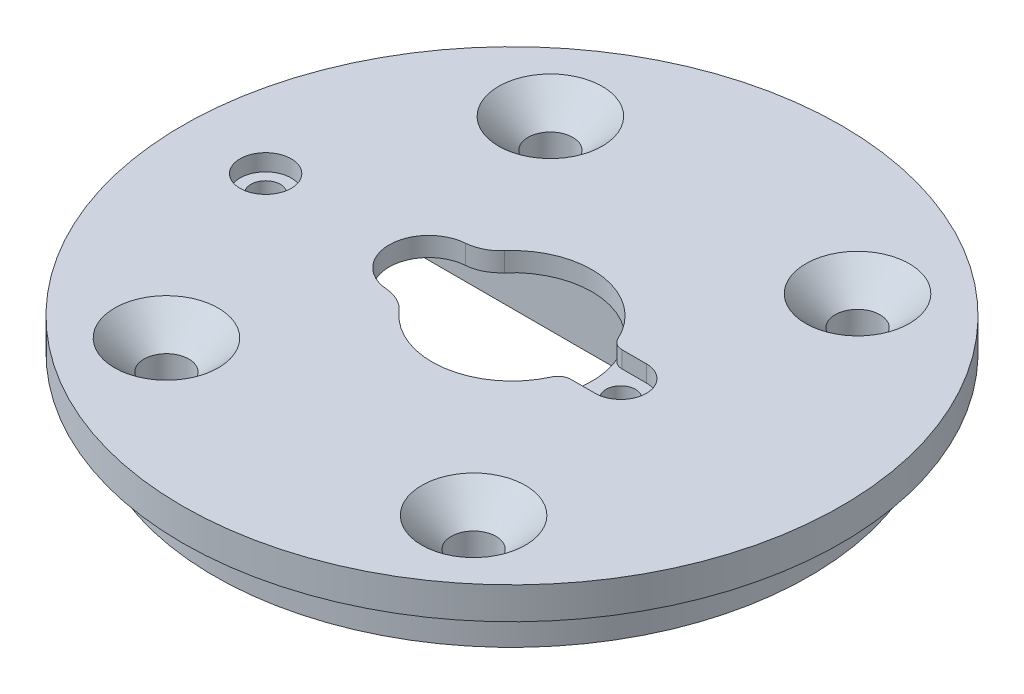
ISO-10303-21;
HEADER;
FILE_DESCRIPTION(('STEP AP214'),'2;1');
FILE_NAME('part.step','',(''),(''),'','','');
FILE_SCHEMA(('AUTOMOTIVE_DESIGN { 1 0 10303 214 1 1 1 1 }'));
ENDSEC;
DATA;
#1=APPLICATION_CONTEXT('core data for automotive mechanical design processes');
#2=APPLICATION_PROTOCOL_DEFINITION('international standard','automotive_design',2000,#1);
#3=PRODUCT_CONTEXT('',#1,'mechanical');
#4=PRODUCT('Part','Part','',(#3));
#5=PRODUCT_RELATED_PRODUCT_CATEGORY('part','',(#4));
#6=PRODUCT_DEFINITION_FORMATION('','',#4);
#7=PRODUCT_DEFINITION_CONTEXT('part definition',#1,'design');
#8=PRODUCT_DEFINITION('design','',#6,#7);
#9=PRODUCT_DEFINITION_SHAPE('','',#8);
#10=(LENGTH_UNIT() NAMED_UNIT(*) SI_UNIT(.MILLI.,.METRE.));
#11=(NAMED_UNIT(*) PLANE_ANGLE_UNIT() SI_UNIT($,.RADIAN.));
#12=(NAMED_UNIT(*) SI_UNIT($,.STERADIAN.) SOLID_ANGLE_UNIT());
#13=UNCERTAINTY_MEASURE_WITH_UNIT(LENGTH_MEASURE(1.E-05),#10,'distance_accuracy_value','');
#14=(GEOMETRIC_REPRESENTATION_CONTEXT(3) GLOBAL_UNCERTAINTY_ASSIGNED_CONTEXT((#13)) GLOBAL_UNIT_ASSIGNED_CONTEXT((#10,
#11,#12)) REPRESENTATION_CONTEXT('',''));
#15=CARTESIAN_POINT('',(0.,0.,0.));
#16=DIRECTION('',(0.,0.,1.));
#17=DIRECTION('',(1.,0.,0.));
#18=AXIS2_PLACEMENT_3D('',#15,#16,#17);
#19=CARTESIAN_POINT('',(37.5,0.,-13.));
#20=DIRECTION('',(0.,1.,0.));
#21=DIRECTION('',(0.,0.,1.));
#22=AXIS2_PLACEMENT_3D('',#19,#20,#21);
#23=CYLINDRICAL_SURFACE('',#22,1.15);
#24=CARTESIAN_POINT('',(37.5,0.5,-13.));
#25=DIRECTION('',(0.,-1.,0.));
#26=DIRECTION('',(0.,0.,-1.));
#27=AXIS2_PLACEMENT_3D('',#24,#25,#26);
#28=CIRCLE('',#27,1.15);
#29=CARTESIAN_POINT('',(37.5,0.5,-14.15));
#30=VERTEX_POINT('',#29);
#31=EDGE_CURVE('E237',#30,#30,#28,.T.);
#32=ORIENTED_EDGE('',*,*,#31,.T.);
#33=EDGE_LOOP('',(#32));
#34=FACE_BOUND('',#33,.T.);
#35=CARTESIAN_POINT('',(37.5,4.7,-13.));
#36=DIRECTION('',(0.,1.,0.));
#37=DIRECTION('',(0.,0.,1.));
#38=AXIS2_PLACEMENT_3D('',#35,#36,#37);
#39=CIRCLE('',#38,1.15);
#40=CARTESIAN_POINT('',(37.5,4.7,-11.85));
#41=VERTEX_POINT('',#40);
#42=EDGE_CURVE('E181',#41,#41,#39,.F.);
#43=ORIENTED_EDGE('',*,*,#42,.F.);
#44=EDGE_LOOP('',(#43));
#45=FACE_BOUND('',#44,.T.);
#46=ADVANCED_FACE('F37',(#34,#45),#23,.F.);
#47=CARTESIAN_POINT('',(0.,6.,0.));
#48=DIRECTION('',(0.,1.,0.));
#49=DIRECTION('',(0.,0.,1.));
#50=AXIS2_PLACEMENT_3D('',#47,#48,#49);
#51=PLANE('',#50);
#52=CARTESIAN_POINT('',(41.,6.,2.));
#53=DIRECTION('',(0.,1.,0.));
#54=DIRECTION('',(0.,0.,1.));
#55=AXIS2_PLACEMENT_3D('',#52,#53,#54);
#56=CIRCLE('',#55,4.04999999999999);
#57=CARTESIAN_POINT('',(41.,6.,6.04999999999999));
#58=VERTEX_POINT('',#57);
#59=EDGE_CURVE('E346',#58,#58,#56,.F.);
#60=ORIENTED_EDGE('',*,*,#59,.T.);
#61=EDGE_LOOP('',(#60));
#62=FACE_BOUND('',#61,.T.);
#63=CARTESIAN_POINT('',(41.,6.,-28.));
#64=DIRECTION('',(0.,1.,0.));
#65=DIRECTION('',(0.,0.,1.));
#66=AXIS2_PLACEMENT_3D('',#63,#64,#65);
#67=CIRCLE('',#66,4.05);
#68=CARTESIAN_POINT('',(41.,6.,-23.95));
#69=VERTEX_POINT('',#68);
#70=EDGE_CURVE('E343',#69,#69,#67,.F.);
#71=ORIENTED_EDGE('',*,*,#70,.T.);
#72=EDGE_LOOP('',(#71));
#73=FACE_BOUND('',#72,.T.);
#74=CARTESIAN_POINT('',(17.,6.,-28.));
#75=DIRECTION('',(0.,1.,0.));
#76=DIRECTION('',(0.,0.,1.));
#77=AXIS2_PLACEMENT_3D('',#74,#75,#76);
#78=CIRCLE('',#77,4.05);
#79=CARTESIAN_POINT('',(17.,6.,-23.95));
#80=VERTEX_POINT('',#79);
#81=EDGE_CURVE('E340',#80,#80,#78,.F.);
#82=ORIENTED_EDGE('',*,*,#81,.T.);
#83=EDGE_LOOP('',(#82));
#84=FACE_BOUND('',#83,.T.);
#85=CARTESIAN_POINT('',(17.,6.,2.));
#86=DIRECTION('',(0.,1.,0.));
#87=DIRECTION('',(0.,0.,1.));
#88=AXIS2_PLACEMENT_3D('',#85,#86,#87);
#89=CIRCLE('',#88,4.04999999999999);
#90=CARTESIAN_POINT('',(17.,6.,6.04999999999999));
#91=VERTEX_POINT('',#90);
#92=EDGE_CURVE('E337',#91,#91,#89,.F.);
#93=ORIENTED_EDGE('',*,*,#92,.T.);
#94=EDGE_LOOP('',(#93));
#95=FACE_BOUND('',#94,.T.);
#96=CARTESIAN_POINT('',(29.,6.,-13.));
#97=DIRECTION('',(0.,1.,0.));
#98=DIRECTION('',(0.,0.,1.));
#99=AXIS2_PLACEMENT_3D('',#96,#97,#98);
#100=CIRCLE('',#99,25.75);
#101=CARTESIAN_POINT('',(29.,6.,12.75));
#102=VERTEX_POINT('',#101);
#103=EDGE_CURVE('E291',#102,#102,#100,.T.);
#104=ORIENTED_EDGE('',*,*,#103,.T.);
#105=EDGE_LOOP('',(#104));
#106=FACE_BOUND('',#105,.T.);
#107=CARTESIAN_POINT('',(9.75000000000001,6.,-13.));
#108=DIRECTION('',(0.,1.,0.));
#109=DIRECTION('',(0.,0.,1.));
#110=AXIS2_PLACEMENT_3D('',#107,#108,#109);
#111=CIRCLE('',#110,2.);
#112=CARTESIAN_POINT('',(9.75000000000001,6.,-11.));
#113=VERTEX_POINT('',#112);
#114=EDGE_CURVE('E201',#113,#113,#111,.T.);
#115=ORIENTED_EDGE('',*,*,#114,.F.);
#116=EDGE_LOOP('',(#115));
#117=FACE_BOUND('',#116,.T.);
#118=DIRECTION('',(-1.,0.,0.));
#119=VECTOR('',#118,1.);
#120=CARTESIAN_POINT('',(0.,6.,-11.));
#121=LINE('',#120,#119);
#122=CARTESIAN_POINT('',(37.5,6.,-11.));
#123=VERTEX_POINT('',#122);
#124=CARTESIAN_POINT('',(35.6001893912221,6.,-11.));
#125=VERTEX_POINT('',#124);
#126=EDGE_CURVE('E184',#123,#125,#121,.T.);
#127=ORIENTED_EDGE('',*,*,#126,.T.);
#128=CARTESIAN_POINT('',(35.6001893912221,6.,-9.99999999999999));
#129=DIRECTION('',(0.,1.,0.));
#130=DIRECTION('',(0.,0.,1.));
#131=AXIS2_PLACEMENT_3D('',#128,#129,#130);
#132=CIRCLE('',#131,1.);
#133=CARTESIAN_POINT('',(34.6898184407087,6.,-10.4137931034483));
#134=VERTEX_POINT('',#133);
#135=EDGE_CURVE('E325',#125,#134,#132,.T.);
#136=ORIENTED_EDGE('',*,*,#135,.T.);
#137=CARTESIAN_POINT('',(29.,6.,-13.));
#138=DIRECTION('',(0.,1.,0.));
#139=DIRECTION('',(0.,0.,1.));
#140=AXIS2_PLACEMENT_3D('',#137,#138,#139);
#141=CIRCLE('',#140,6.25000000000001);
#142=CARTESIAN_POINT('',(24.2909303534303,6.,-8.89060064440599));
#143=VERTEX_POINT('',#142);
#144=EDGE_CURVE('E284',#134,#143,#141,.F.);
#145=ORIENTED_EDGE('',*,*,#144,.T.);
#146=CARTESIAN_POINT('',(22.0305769230769,6.,-6.91808895372087));
#147=DIRECTION('',(0.,1.,0.));
#148=DIRECTION('',(0.,0.,1.));
#149=AXIS2_PLACEMENT_3D('',#146,#147,#148);
#150=CIRCLE('',#149,3.);
#151=CARTESIAN_POINT('',(22.2614407313997,6.,-9.9091927469729));
#152=VERTEX_POINT('',#151);
#153=EDGE_CURVE('E302',#143,#152,#150,.T.);
#154=ORIENTED_EDGE('',*,*,#153,.T.);
#155=CARTESIAN_POINT('',(22.5,6.,-13.));
#156=DIRECTION('',(0.,1.,0.));
#157=DIRECTION('',(0.,0.,1.));
#158=AXIS2_PLACEMENT_3D('',#155,#156,#157);
#159=CIRCLE('',#158,3.1);
#160=CARTESIAN_POINT('',(22.2614407313997,6.,-16.0908072530271));
#161=VERTEX_POINT('',#160);
#162=EDGE_CURVE('E288',#152,#161,#159,.F.);
#163=ORIENTED_EDGE('',*,*,#162,.T.);
#164=CARTESIAN_POINT('',(22.0305769230769,6.,-19.0819110462791));
#165=DIRECTION('',(0.,1.,0.));
#166=DIRECTION('',(0.,0.,1.));
#167=AXIS2_PLACEMENT_3D('',#164,#165,#166);
#168=CIRCLE('',#167,3.);
#169=CARTESIAN_POINT('',(24.2909303534303,6.,-17.109399355594));
#170=VERTEX_POINT('',#169);
#171=EDGE_CURVE('E300',#161,#170,#168,.T.);
#172=ORIENTED_EDGE('',*,*,#171,.T.);
#173=CARTESIAN_POINT('',(34.6898184407087,6.,-15.5862068965517));
#174=VERTEX_POINT('',#173);
#175=EDGE_CURVE('E285',#170,#174,#141,.F.);
#176=ORIENTED_EDGE('',*,*,#175,.T.);
#177=CARTESIAN_POINT('',(35.6001893912221,6.,-16.));
#178=DIRECTION('',(0.,1.,0.));
#179=DIRECTION('',(0.,0.,1.));
#180=AXIS2_PLACEMENT_3D('',#177,#178,#179);
#181=CIRCLE('',#180,1.);
#182=CARTESIAN_POINT('',(35.6001893912221,6.,-15.));
#183=VERTEX_POINT('',#182);
#184=EDGE_CURVE('E323',#174,#183,#181,.T.);
#185=ORIENTED_EDGE('',*,*,#184,.T.);
#186=DIRECTION('',(-1.,0.,0.));
#187=VECTOR('',#186,1.);
#188=CARTESIAN_POINT('',(0.,6.,-15.));
#189=LINE('',#188,#187);
#190=CARTESIAN_POINT('',(37.5,6.,-15.));
#191=VERTEX_POINT('',#190);
#192=EDGE_CURVE('E191',#191,#183,#189,.T.);
#193=ORIENTED_EDGE('',*,*,#192,.F.);
#194=CARTESIAN_POINT('',(37.5,6.,-13.));
#195=DIRECTION('',(0.,1.,0.));
#196=DIRECTION('',(0.,0.,1.));
#197=AXIS2_PLACEMENT_3D('',#194,#195,#196);
#198=CIRCLE('',#197,2.);
#199=EDGE_CURVE('E169',#123,#191,#198,.T.);
#200=ORIENTED_EDGE('',*,*,#199,.F.);
#201=EDGE_LOOP('',(#127,#136,#145,#154,#163,#172,#176,#185,#193,#200));
#202=FACE_BOUND('',#201,.T.);
#203=ADVANCED_FACE('F366',(#62,#73,#84,#95,#106,#117,#202),#51,.T.);
#204=CARTESIAN_POINT('',(29.,0.,-13.));
#205=DIRECTION('',(0.,1.,0.));
#206=DIRECTION('',(0.,0.,1.));
#207=AXIS2_PLACEMENT_3D('',#204,#205,#206);
#208=CYLINDRICAL_SURFACE('',#207,6.25000000000001);
#209=ORIENTED_EDGE('',*,*,#144,.F.);
#210=DIRECTION('',(0.,1.,0.));
#211=VECTOR('',#210,1.);
#212=CARTESIAN_POINT('',(34.6898184407087,0.,-10.4137931034483));
#213=LINE('',#212,#211);
#214=CARTESIAN_POINT('',(34.6898184407087,4.7,-10.4137931034483));
#215=VERTEX_POINT('',#214);
#216=EDGE_CURVE('E330',#134,#215,#213,.F.);
#217=ORIENTED_EDGE('',*,*,#216,.T.);
#218=CARTESIAN_POINT('',(29.,4.7,-13.));
#219=DIRECTION('',(0.,1.,0.));
#220=DIRECTION('',(0.,0.,1.));
#221=AXIS2_PLACEMENT_3D('',#218,#219,#220);
#222=CIRCLE('',#221,6.25000000000001);
#223=CARTESIAN_POINT('',(34.6898184407087,4.7,-15.5862068965517));
#224=VERTEX_POINT('',#223);
#225=EDGE_CURVE('E60',#224,#215,#222,.F.);
#226=ORIENTED_EDGE('',*,*,#225,.F.);
#227=DIRECTION('',(0.,1.,0.));
#228=VECTOR('',#227,1.);
#229=CARTESIAN_POINT('',(34.6898184407087,0.,-15.5862068965517));
#230=LINE('',#229,#228);
#231=EDGE_CURVE('E327',#224,#174,#230,.T.);
#232=ORIENTED_EDGE('',*,*,#231,.T.);
#233=ORIENTED_EDGE('',*,*,#175,.F.);
#234=DIRECTION('',(0.,1.,0.));
#235=VECTOR('',#234,1.);
#236=CARTESIAN_POINT('',(24.2909303534303,0.,-17.109399355594));
#237=LINE('',#236,#235);
#238=CARTESIAN_POINT('',(24.2909303534303,4.5,-17.109399355594));
#239=VERTEX_POINT('',#238);
#240=EDGE_CURVE('E294',#170,#239,#237,.F.);
#241=ORIENTED_EDGE('',*,*,#240,.T.);
#242=CARTESIAN_POINT('',(29.,4.5,-13.));
#243=DIRECTION('',(0.,-1.,0.));
#244=DIRECTION('',(0.,0.,-1.));
#245=AXIS2_PLACEMENT_3D('',#242,#243,#244);
#246=CIRCLE('',#245,6.25000000000001);
#247=CARTESIAN_POINT('',(24.2909303534303,4.5,-8.89060064440599));
#248=VERTEX_POINT('',#247);
#249=EDGE_CURVE('E278',#239,#248,#246,.T.);
#250=ORIENTED_EDGE('',*,*,#249,.T.);
#251=DIRECTION('',(0.,1.,0.));
#252=VECTOR('',#251,1.);
#253=CARTESIAN_POINT('',(24.2909303534303,0.,-8.89060064440599));
#254=LINE('',#253,#252);
#255=EDGE_CURVE('E297',#248,#143,#254,.T.);
#256=ORIENTED_EDGE('',*,*,#255,.T.);
#257=EDGE_LOOP('',(#209,#217,#226,#232,#233,#241,#250,#256));
#258=FACE_BOUND('',#257,.T.);
#259=ADVANCED_FACE('F369',(#258),#208,.F.);
#260=CARTESIAN_POINT('',(9.75000000000001,0.,-13.));
#261=DIRECTION('',(0.,1.,0.));
#262=DIRECTION('',(0.,0.,1.));
#263=AXIS2_PLACEMENT_3D('',#260,#261,#262);
#264=CYLINDRICAL_SURFACE('',#263,1.15);
#265=CARTESIAN_POINT('',(9.75000000000001,0.5,-13.));
#266=DIRECTION('',(0.,1.,0.));
#267=DIRECTION('',(0.,0.,1.));
#268=AXIS2_PLACEMENT_3D('',#265,#266,#267);
#269=CIRCLE('',#268,1.15);
#270=CARTESIAN_POINT('',(9.75000000000001,0.5,-11.85));
#271=VERTEX_POINT('',#270);
#272=EDGE_CURVE('E226',#271,#271,#269,.T.);
#273=ORIENTED_EDGE('',*,*,#272,.F.);
#274=EDGE_LOOP('',(#273));
#275=FACE_BOUND('',#274,.T.);
#276=CARTESIAN_POINT('',(9.75000000000001,4.7,-13.));
#277=DIRECTION('',(0.,1.,0.));
#278=DIRECTION('',(0.,0.,1.));
#279=AXIS2_PLACEMENT_3D('',#276,#277,#278);
#280=CIRCLE('',#279,1.15);
#281=CARTESIAN_POINT('',(9.75000000000001,4.7,-11.85));
#282=VERTEX_POINT('',#281);
#283=EDGE_CURVE('E198',#282,#282,#280,.F.);
#284=ORIENTED_EDGE('',*,*,#283,.F.);
#285=EDGE_LOOP('',(#284));
#286=FACE_BOUND('',#285,.T.);
#287=ADVANCED_FACE('F427',(#275,#286),#264,.F.);
#288=CARTESIAN_POINT('',(35.5,4.5,0.));
#289=DIRECTION('',(-1.,0.,0.));
#290=DIRECTION('',(0.,0.,1.));
#291=AXIS2_PLACEMENT_3D('',#288,#289,#290);
#292=PLANE('',#291);
#293=DIRECTION('',(0.,-1.,0.));
#294=VECTOR('',#293,1.);
#295=CARTESIAN_POINT('',(35.5,4.5,-19.5));
#296=LINE('',#295,#294);
#297=CARTESIAN_POINT('',(35.5,4.5,-19.5));
#298=VERTEX_POINT('',#297);
#299=CARTESIAN_POINT('',(35.5,0.5,-19.5));
#300=VERTEX_POINT('',#299);
#301=EDGE_CURVE('E261',#298,#300,#296,.T.);
#302=ORIENTED_EDGE('',*,*,#301,.T.);
#303=DIRECTION('',(0.,0.,-1.));
#304=VECTOR('',#303,1.);
#305=CARTESIAN_POINT('',(35.5,0.5,-6.5));
#306=LINE('',#305,#304);
#307=CARTESIAN_POINT('',(35.5,0.5,-6.5));
#308=VERTEX_POINT('',#307);
#309=EDGE_CURVE('E207',#308,#300,#306,.T.);
#310=ORIENTED_EDGE('',*,*,#309,.F.);
#311=DIRECTION('',(0.,-1.,0.));
#312=VECTOR('',#311,1.);
#313=CARTESIAN_POINT('',(35.5,4.5,-6.5));
#314=LINE('',#313,#312);
#315=CARTESIAN_POINT('',(35.5,4.5,-6.5));
#316=VERTEX_POINT('',#315);
#317=EDGE_CURVE('E271',#316,#308,#314,.T.);
#318=ORIENTED_EDGE('',*,*,#317,.F.);
#319=DIRECTION('',(0.,0.,-1.));
#320=VECTOR('',#319,1.);
#321=CARTESIAN_POINT('',(35.5,4.5,0.));
#322=LINE('',#321,#320);
#323=EDGE_CURVE('E253',#316,#298,#322,.T.);
#324=ORIENTED_EDGE('',*,*,#323,.T.);
#325=EDGE_LOOP('',(#302,#310,#318,#324));
#326=FACE_BOUND('',#325,.T.);
#327=ADVANCED_FACE('F458',(#326),#292,.T.);
#328=CARTESIAN_POINT('',(0.,3.5,0.));
#329=DIRECTION('',(0.,-1.,0.));
#330=DIRECTION('',(0.,0.,-1.));
#331=AXIS2_PLACEMENT_3D('',#328,#329,#330);
#332=PLANE('',#331);
#333=CARTESIAN_POINT('',(29.,3.5,-13.));
#334=DIRECTION('',(0.,-1.,0.));
#335=DIRECTION('',(0.,0.,-1.));
#336=AXIS2_PLACEMENT_3D('',#333,#334,#335);
#337=CIRCLE('',#336,23.25);
#338=CARTESIAN_POINT('',(29.,3.5,-36.25));
#339=VERTEX_POINT('',#338);
#340=EDGE_CURVE('E241',#339,#339,#337,.T.);
#341=ORIENTED_EDGE('',*,*,#340,.F.);
#342=EDGE_LOOP('',(#341));
#343=FACE_BOUND('',#342,.T.);
#344=CARTESIAN_POINT('',(29.,3.5,-13.));
#345=DIRECTION('',(0.,-1.,0.));
#346=DIRECTION('',(0.,0.,-1.));
#347=AXIS2_PLACEMENT_3D('',#344,#345,#346);
#348=CIRCLE('',#347,25.75);
#349=CARTESIAN_POINT('',(29.,3.5,-38.75));
#350=VERTEX_POINT('',#349);
#351=EDGE_CURVE('E244',#350,#350,#348,.T.);
#352=ORIENTED_EDGE('',*,*,#351,.T.);
#353=EDGE_LOOP('',(#352));
#354=FACE_BOUND('',#353,.T.);
#355=ADVANCED_FACE('F440',(#343,#354),#332,.T.);
#356=CARTESIAN_POINT('',(29.,6.,-13.));
#357=DIRECTION('',(0.,-1.,0.));
#358=DIRECTION('',(0.,0.,-1.));
#359=AXIS2_PLACEMENT_3D('',#356,#357,#358);
#360=CYLINDRICAL_SURFACE('',#359,25.75);
#361=ORIENTED_EDGE('',*,*,#351,.F.);
#362=EDGE_LOOP('',(#361));
#363=FACE_BOUND('',#362,.T.);
#364=ORIENTED_EDGE('',*,*,#103,.F.);
#365=EDGE_LOOP('',(#364));
#366=FACE_BOUND('',#365,.T.);
#367=ADVANCED_FACE('F436',(#363,#366),#360,.T.);
#368=CARTESIAN_POINT('',(0.,0.,0.));
#369=DIRECTION('',(0.,1.,0.));
#370=DIRECTION('',(0.,0.,1.));
#371=AXIS2_PLACEMENT_3D('',#368,#369,#370);
#372=PLANE('',#371);
#373=CARTESIAN_POINT('',(17.,0.,2.));
#374=DIRECTION('',(0.,-1.,0.));
#375=DIRECTION('',(0.,0.,-1.));
#376=AXIS2_PLACEMENT_3D('',#373,#374,#375);
#377=CIRCLE('',#376,1.75);
#378=CARTESIAN_POINT('',(17.,0.,0.249999999999998));
#379=VERTEX_POINT('',#378);
#380=EDGE_CURVE('E527',#379,#379,#377,.T.);
#381=ORIENTED_EDGE('',*,*,#380,.F.);
#382=EDGE_LOOP('',(#381));
#383=FACE_BOUND('',#382,.T.);
#384=CARTESIAN_POINT('',(17.,0.,-28.));
#385=DIRECTION('',(0.,-1.,0.));
#386=DIRECTION('',(0.,0.,-1.));
#387=AXIS2_PLACEMENT_3D('',#384,#385,#386);
#388=CIRCLE('',#387,1.75);
#389=CARTESIAN_POINT('',(17.,0.,-29.75));
#390=VERTEX_POINT('',#389);
#391=EDGE_CURVE('E523',#390,#390,#388,.T.);
#392=ORIENTED_EDGE('',*,*,#391,.F.);
#393=EDGE_LOOP('',(#392));
#394=FACE_BOUND('',#393,.T.);
#395=CARTESIAN_POINT('',(41.,0.,-28.));
#396=DIRECTION('',(0.,-1.,0.));
#397=DIRECTION('',(0.,0.,-1.));
#398=AXIS2_PLACEMENT_3D('',#395,#396,#397);
#399=CIRCLE('',#398,1.75);
#400=CARTESIAN_POINT('',(41.,0.,-29.75));
#401=VERTEX_POINT('',#400);
#402=EDGE_CURVE('E521',#401,#401,#399,.T.);
#403=ORIENTED_EDGE('',*,*,#402,.F.);
#404=EDGE_LOOP('',(#403));
#405=FACE_BOUND('',#404,.T.);
#406=CARTESIAN_POINT('',(41.,0.,2.));
#407=DIRECTION('',(0.,-1.,0.));
#408=DIRECTION('',(0.,0.,-1.));
#409=AXIS2_PLACEMENT_3D('',#406,#407,#408);
#410=CIRCLE('',#409,1.75);
#411=CARTESIAN_POINT('',(41.,0.,0.249999999999994));
#412=VERTEX_POINT('',#411);
#413=EDGE_CURVE('E206',#412,#412,#410,.T.);
#414=ORIENTED_EDGE('',*,*,#413,.F.);
#415=EDGE_LOOP('',(#414));
#416=FACE_BOUND('',#415,.T.);
#417=DIRECTION('',(1.,0.,0.));
#418=VECTOR('',#417,1.);
#419=CARTESIAN_POINT('',(0.,0.,-6.5));
#420=LINE('',#419,#418);
#421=CARTESIAN_POINT('',(6.67708576372699,0.,-6.5));
#422=VERTEX_POINT('',#421);
#423=CARTESIAN_POINT('',(40.5,0.,-6.5));
#424=VERTEX_POINT('',#423);
#425=EDGE_CURVE('E254',#422,#424,#420,.T.);
#426=ORIENTED_EDGE('',*,*,#425,.T.);
#427=DIRECTION('',(0.,0.,1.));
#428=VECTOR('',#427,1.);
#429=CARTESIAN_POINT('',(40.5,0.,-6.5));
#430=LINE('',#429,#428);
#431=CARTESIAN_POINT('',(40.5,0.,-19.5));
#432=VERTEX_POINT('',#431);
#433=EDGE_CURVE('E211',#432,#424,#430,.T.);
#434=ORIENTED_EDGE('',*,*,#433,.F.);
#435=DIRECTION('',(1.,0.,0.));
#436=VECTOR('',#435,1.);
#437=CARTESIAN_POINT('',(0.,0.,-19.5));
#438=LINE('',#437,#436);
#439=CARTESIAN_POINT('',(6.67708576372699,0.,-19.5));
#440=VERTEX_POINT('',#439);
#441=EDGE_CURVE('E247',#440,#432,#438,.T.);
#442=ORIENTED_EDGE('',*,*,#441,.F.);
#443=CARTESIAN_POINT('',(29.,0.,-13.));
#444=DIRECTION('',(0.,-1.,0.));
#445=DIRECTION('',(0.,0.,-1.));
#446=AXIS2_PLACEMENT_3D('',#443,#444,#445);
#447=CIRCLE('',#446,23.25);
#448=EDGE_CURVE('E240',#440,#422,#447,.T.);
#449=ORIENTED_EDGE('',*,*,#448,.T.);
#450=EDGE_LOOP('',(#426,#434,#442,#449));
#451=FACE_BOUND('',#450,.T.);
#452=ADVANCED_FACE('F431',(#383,#394,#405,#416,#451),#372,.F.);
#453=CARTESIAN_POINT('',(22.5,0.,-13.));
#454=DIRECTION('',(0.,1.,0.));
#455=DIRECTION('',(0.,0.,1.));
#456=AXIS2_PLACEMENT_3D('',#453,#454,#455);
#457=CYLINDRICAL_SURFACE('',#456,3.1);
#458=DIRECTION('',(0.,1.,0.));
#459=VECTOR('',#458,1.);
#460=CARTESIAN_POINT('',(22.2614407313997,0.,-9.9091927469729));
#461=LINE('',#460,#459);
#462=CARTESIAN_POINT('',(22.2614407313997,4.5,-9.9091927469729));
#463=VERTEX_POINT('',#462);
#464=EDGE_CURVE('E306',#152,#463,#461,.F.);
#465=ORIENTED_EDGE('',*,*,#464,.T.);
#466=CARTESIAN_POINT('',(22.5,4.5,-13.));
#467=DIRECTION('',(0.,-1.,0.));
#468=DIRECTION('',(0.,0.,-1.));
#469=AXIS2_PLACEMENT_3D('',#466,#467,#468);
#470=CIRCLE('',#469,3.1);
#471=CARTESIAN_POINT('',(22.2614407313997,4.5,-16.0908072530271));
#472=VERTEX_POINT('',#471);
#473=EDGE_CURVE('E267',#463,#472,#470,.T.);
#474=ORIENTED_EDGE('',*,*,#473,.T.);
#475=DIRECTION('',(0.,1.,0.));
#476=VECTOR('',#475,1.);
#477=CARTESIAN_POINT('',(22.2614407313997,0.,-16.0908072530271));
#478=LINE('',#477,#476);
#479=EDGE_CURVE('E304',#472,#161,#478,.T.);
#480=ORIENTED_EDGE('',*,*,#479,.T.);
#481=ORIENTED_EDGE('',*,*,#162,.F.);
#482=EDGE_LOOP('',(#465,#474,#480,#481));
#483=FACE_BOUND('',#482,.T.);
#484=ADVANCED_FACE('F394',(#483),#457,.F.);
#485=CARTESIAN_POINT('',(22.0305769230769,0.,-6.91808895372087));
#486=DIRECTION('',(0.,1.,0.));
#487=DIRECTION('',(0.,0.,1.));
#488=AXIS2_PLACEMENT_3D('',#485,#486,#487);
#489=CYLINDRICAL_SURFACE('',#488,3.);
#490=ORIENTED_EDGE('',*,*,#255,.F.);
#491=CARTESIAN_POINT('',(22.0305769230769,4.5,-6.91808895372087));
#492=DIRECTION('',(0.,-1.,0.));
#493=DIRECTION('',(0.,0.,-1.));
#494=AXIS2_PLACEMENT_3D('',#491,#492,#493);
#495=CIRCLE('',#494,3.);
#496=EDGE_CURVE('E281',#248,#463,#495,.F.);
#497=ORIENTED_EDGE('',*,*,#496,.T.);
#498=ORIENTED_EDGE('',*,*,#464,.F.);
#499=ORIENTED_EDGE('',*,*,#153,.F.);
#500=EDGE_LOOP('',(#490,#497,#498,#499));
#501=FACE_BOUND('',#500,.T.);
#502=ADVANCED_FACE('F397',(#501),#489,.T.);
#503=CARTESIAN_POINT('',(22.0305769230769,0.,-19.0819110462791));
#504=DIRECTION('',(0.,1.,0.));
#505=DIRECTION('',(0.,0.,1.));
#506=AXIS2_PLACEMENT_3D('',#503,#504,#505);
#507=CYLINDRICAL_SURFACE('',#506,3.);
#508=ORIENTED_EDGE('',*,*,#479,.F.);
#509=CARTESIAN_POINT('',(22.0305769230769,4.5,-19.0819110462791));
#510=DIRECTION('',(0.,-1.,0.));
#511=DIRECTION('',(0.,0.,-1.));
#512=AXIS2_PLACEMENT_3D('',#509,#510,#511);
#513=CIRCLE('',#512,3.);
#514=EDGE_CURVE('E309',#472,#239,#513,.F.);
#515=ORIENTED_EDGE('',*,*,#514,.T.);
#516=ORIENTED_EDGE('',*,*,#240,.F.);
#517=ORIENTED_EDGE('',*,*,#171,.F.);
#518=EDGE_LOOP('',(#508,#515,#516,#517));
#519=FACE_BOUND('',#518,.T.);
#520=ADVANCED_FACE('F404',(#519),#507,.T.);
#521=CARTESIAN_POINT('',(0.,4.5,-19.5));
#522=DIRECTION('',(0.,0.,-1.));
#523=DIRECTION('',(-1.,0.,0.));
#524=AXIS2_PLACEMENT_3D('',#521,#522,#523);
#525=PLANE('',#524);
#526=ORIENTED_EDGE('',*,*,#441,.T.);
#527=DIRECTION('',(0.,-1.,0.));
#528=VECTOR('',#527,1.);
#529=CARTESIAN_POINT('',(40.5,0.5,-19.5));
#530=LINE('',#529,#528);
#531=CARTESIAN_POINT('',(40.5,0.5,-19.5));
#532=VERTEX_POINT('',#531);
#533=EDGE_CURVE('E219',#532,#432,#530,.T.);
#534=ORIENTED_EDGE('',*,*,#533,.F.);
#535=DIRECTION('',(1.,0.,0.));
#536=VECTOR('',#535,1.);
#537=CARTESIAN_POINT('',(35.5,0.5,-19.5));
#538=LINE('',#537,#536);
#539=EDGE_CURVE('E210',#300,#532,#538,.T.);
#540=ORIENTED_EDGE('',*,*,#539,.F.);
#541=ORIENTED_EDGE('',*,*,#301,.F.);
#542=DIRECTION('',(1.,0.,0.));
#543=VECTOR('',#542,1.);
#544=CARTESIAN_POINT('',(0.,4.5,-19.5));
#545=LINE('',#544,#543);
#546=CARTESIAN_POINT('',(11.5,4.5,-19.5));
#547=VERTEX_POINT('',#546);
#548=EDGE_CURVE('E250',#547,#298,#545,.T.);
#549=ORIENTED_EDGE('',*,*,#548,.F.);
#550=DIRECTION('',(0.,-1.,0.));
#551=VECTOR('',#550,1.);
#552=CARTESIAN_POINT('',(11.5,4.5,-19.5));
#553=LINE('',#552,#551);
#554=CARTESIAN_POINT('',(11.5,0.5,-19.5));
#555=VERTEX_POINT('',#554);
#556=EDGE_CURVE('E264',#547,#555,#553,.T.);
#557=ORIENTED_EDGE('',*,*,#556,.T.);
#558=DIRECTION('',(1.,0.,0.));
#559=VECTOR('',#558,1.);
#560=CARTESIAN_POINT('',(11.5,0.5,-19.5));
#561=LINE('',#560,#559);
#562=CARTESIAN_POINT('',(6.67708576372699,0.5,-19.5));
#563=VERTEX_POINT('',#562);
#564=EDGE_CURVE('E222',#563,#555,#561,.T.);
#565=ORIENTED_EDGE('',*,*,#564,.F.);
#566=DIRECTION('',(0.,-1.,0.));
#567=VECTOR('',#566,1.);
#568=CARTESIAN_POINT('',(6.67708576372699,3.5,-19.5));
#569=LINE('',#568,#567);
#570=EDGE_CURVE('E317',#563,#440,#569,.T.);
#571=ORIENTED_EDGE('',*,*,#570,.T.);
#572=EDGE_LOOP('',(#526,#534,#540,#541,#549,#557,#565,#571));
#573=FACE_BOUND('',#572,.T.);
#574=ADVANCED_FACE('F445',(#573),#525,.F.);
#575=CARTESIAN_POINT('',(11.5,4.5,0.));
#576=DIRECTION('',(-1.,0.,0.));
#577=DIRECTION('',(0.,0.,1.));
#578=AXIS2_PLACEMENT_3D('',#575,#576,#577);
#579=PLANE('',#578);
#580=DIRECTION('',(0.,-1.,0.));
#581=VECTOR('',#580,1.);
#582=CARTESIAN_POINT('',(11.5,4.5,-6.5));
#583=LINE('',#582,#581);
#584=CARTESIAN_POINT('',(11.5,4.5,-6.5));
#585=VERTEX_POINT('',#584);
#586=CARTESIAN_POINT('',(11.5,0.5,-6.5));
#587=VERTEX_POINT('',#586);
#588=EDGE_CURVE('E268',#585,#587,#583,.T.);
#589=ORIENTED_EDGE('',*,*,#588,.T.);
#590=DIRECTION('',(0.,0.,1.));
#591=VECTOR('',#590,1.);
#592=CARTESIAN_POINT('',(11.5,0.5,-6.5));
#593=LINE('',#592,#591);
#594=EDGE_CURVE('E196',#555,#587,#593,.T.);
#595=ORIENTED_EDGE('',*,*,#594,.F.);
#596=ORIENTED_EDGE('',*,*,#556,.F.);
#597=DIRECTION('',(0.,0.,-1.));
#598=VECTOR('',#597,1.);
#599=CARTESIAN_POINT('',(11.5,4.5,0.));
#600=LINE('',#599,#598);
#601=EDGE_CURVE('E258',#585,#547,#600,.T.);
#602=ORIENTED_EDGE('',*,*,#601,.F.);
#603=EDGE_LOOP('',(#589,#595,#596,#602));
#604=FACE_BOUND('',#603,.T.);
#605=ADVANCED_FACE('F449',(#604),#579,.F.);
#606=CARTESIAN_POINT('',(0.,4.5,-6.5));
#607=DIRECTION('',(0.,0.,-1.));
#608=DIRECTION('',(-1.,0.,0.));
#609=AXIS2_PLACEMENT_3D('',#606,#607,#608);
#610=PLANE('',#609);
#611=ORIENTED_EDGE('',*,*,#425,.F.);
#612=DIRECTION('',(0.,-1.,0.));
#613=VECTOR('',#612,1.);
#614=CARTESIAN_POINT('',(6.67708576372699,3.5,-6.5));
#615=LINE('',#614,#613);
#616=CARTESIAN_POINT('',(6.67708576372699,0.5,-6.5));
#617=VERTEX_POINT('',#616);
#618=EDGE_CURVE('E314',#422,#617,#615,.F.);
#619=ORIENTED_EDGE('',*,*,#618,.T.);
#620=DIRECTION('',(-1.,0.,0.));
#621=VECTOR('',#620,1.);
#622=CARTESIAN_POINT('',(11.5,0.5,-6.5));
#623=LINE('',#622,#621);
#624=EDGE_CURVE('E231',#587,#617,#623,.T.);
#625=ORIENTED_EDGE('',*,*,#624,.F.);
#626=ORIENTED_EDGE('',*,*,#588,.F.);
#627=DIRECTION('',(1.,0.,0.));
#628=VECTOR('',#627,1.);
#629=CARTESIAN_POINT('',(0.,4.5,-6.5));
#630=LINE('',#629,#628);
#631=EDGE_CURVE('E256',#585,#316,#630,.T.);
#632=ORIENTED_EDGE('',*,*,#631,.T.);
#633=ORIENTED_EDGE('',*,*,#317,.T.);
#634=DIRECTION('',(-1.,0.,0.));
#635=VECTOR('',#634,1.);
#636=CARTESIAN_POINT('',(35.5,0.5,-6.5));
#637=LINE('',#636,#635);
#638=CARTESIAN_POINT('',(40.5,0.5,-6.5));
#639=VERTEX_POINT('',#638);
#640=EDGE_CURVE('E217',#639,#308,#637,.T.);
#641=ORIENTED_EDGE('',*,*,#640,.F.);
#642=DIRECTION('',(0.,-1.,0.));
#643=VECTOR('',#642,1.);
#644=CARTESIAN_POINT('',(40.5,0.5,-6.5));
#645=LINE('',#644,#643);
#646=EDGE_CURVE('E223',#639,#424,#645,.T.);
#647=ORIENTED_EDGE('',*,*,#646,.T.);
#648=EDGE_LOOP('',(#611,#619,#625,#626,#632,#633,#641,#647));
#649=FACE_BOUND('',#648,.T.);
#650=ADVANCED_FACE('F454',(#649),#610,.T.);
#651=CARTESIAN_POINT('',(0.,4.5,0.));
#652=DIRECTION('',(0.,-1.,0.));
#653=DIRECTION('',(0.,0.,-1.));
#654=AXIS2_PLACEMENT_3D('',#651,#652,#653);
#655=PLANE('',#654);
#656=ORIENTED_EDGE('',*,*,#249,.F.);
#657=ORIENTED_EDGE('',*,*,#514,.F.);
#658=ORIENTED_EDGE('',*,*,#473,.F.);
#659=ORIENTED_EDGE('',*,*,#496,.F.);
#660=EDGE_LOOP('',(#656,#657,#658,#659));
#661=FACE_BOUND('',#660,.T.);
#662=ORIENTED_EDGE('',*,*,#548,.T.);
#663=ORIENTED_EDGE('',*,*,#323,.F.);
#664=ORIENTED_EDGE('',*,*,#631,.F.);
#665=ORIENTED_EDGE('',*,*,#601,.T.);
#666=EDGE_LOOP('',(#662,#663,#664,#665));
#667=FACE_BOUND('',#666,.T.);
#668=ADVANCED_FACE('F399',(#661,#667),#655,.T.);
#669=CARTESIAN_POINT('',(29.,3.5,-13.));
#670=DIRECTION('',(0.,-1.,0.));
#671=DIRECTION('',(0.,0.,-1.));
#672=AXIS2_PLACEMENT_3D('',#669,#670,#671);
#673=CYLINDRICAL_SURFACE('',#672,23.25);
#674=ORIENTED_EDGE('',*,*,#570,.F.);
#675=CARTESIAN_POINT('',(29.,0.5,-13.));
#676=DIRECTION('',(0.,1.,0.));
#677=DIRECTION('',(0.,0.,1.));
#678=AXIS2_PLACEMENT_3D('',#675,#676,#677);
#679=CIRCLE('',#678,23.25);
#680=EDGE_CURVE('E312',#617,#563,#679,.F.);
#681=ORIENTED_EDGE('',*,*,#680,.F.);
#682=ORIENTED_EDGE('',*,*,#618,.F.);
#683=ORIENTED_EDGE('',*,*,#448,.F.);
#684=EDGE_LOOP('',(#674,#681,#682,#683));
#685=FACE_BOUND('',#684,.T.);
#686=ORIENTED_EDGE('',*,*,#340,.T.);
#687=EDGE_LOOP('',(#686));
#688=FACE_BOUND('',#687,.T.);
#689=ADVANCED_FACE('F467',(#685,#688),#673,.T.);
#690=CARTESIAN_POINT('',(0.,0.5,0.));
#691=DIRECTION('',(0.,1.,0.));
#692=DIRECTION('',(0.,0.,1.));
#693=AXIS2_PLACEMENT_3D('',#690,#691,#692);
#694=PLANE('',#693);
#695=ORIENTED_EDGE('',*,*,#272,.T.);
#696=EDGE_LOOP('',(#695));
#697=FACE_BOUND('',#696,.T.);
#698=ORIENTED_EDGE('',*,*,#624,.T.);
#699=ORIENTED_EDGE('',*,*,#680,.T.);
#700=ORIENTED_EDGE('',*,*,#564,.T.);
#701=ORIENTED_EDGE('',*,*,#594,.T.);
#702=EDGE_LOOP('',(#698,#699,#700,#701));
#703=FACE_BOUND('',#702,.T.);
#704=ADVANCED_FACE('F470',(#697,#703),#694,.F.);
#705=CARTESIAN_POINT('',(40.5,0.5,-6.5));
#706=DIRECTION('',(1.,0.,0.));
#707=DIRECTION('',(0.,0.,-1.));
#708=AXIS2_PLACEMENT_3D('',#705,#706,#707);
#709=PLANE('',#708);
#710=ORIENTED_EDGE('',*,*,#433,.T.);
#711=ORIENTED_EDGE('',*,*,#646,.F.);
#712=DIRECTION('',(0.,0.,1.));
#713=VECTOR('',#712,1.);
#714=CARTESIAN_POINT('',(40.5,0.5,-6.5));
#715=LINE('',#714,#713);
#716=EDGE_CURVE('E214',#532,#639,#715,.T.);
#717=ORIENTED_EDGE('',*,*,#716,.F.);
#718=ORIENTED_EDGE('',*,*,#533,.T.);
#719=EDGE_LOOP('',(#710,#711,#717,#718));
#720=FACE_BOUND('',#719,.T.);
#721=ADVANCED_FACE('F477',(#720),#709,.F.);
#722=CARTESIAN_POINT('',(0.,0.5,0.));
#723=DIRECTION('',(0.,-1.,0.));
#724=DIRECTION('',(0.,0.,-1.));
#725=AXIS2_PLACEMENT_3D('',#722,#723,#724);
#726=PLANE('',#725);
#727=ORIENTED_EDGE('',*,*,#31,.F.);
#728=EDGE_LOOP('',(#727));
#729=FACE_BOUND('',#728,.T.);
#730=ORIENTED_EDGE('',*,*,#309,.T.);
#731=ORIENTED_EDGE('',*,*,#539,.T.);
#732=ORIENTED_EDGE('',*,*,#716,.T.);
#733=ORIENTED_EDGE('',*,*,#640,.T.);
#734=EDGE_LOOP('',(#730,#731,#732,#733));
#735=FACE_BOUND('',#734,.T.);
#736=ADVANCED_FACE('F481',(#729,#735),#726,.T.);
#737=CARTESIAN_POINT('',(9.75000000000001,4.7,-13.));
#738=DIRECTION('',(0.,1.,0.));
#739=DIRECTION('',(0.,0.,1.));
#740=AXIS2_PLACEMENT_3D('',#737,#738,#739);
#741=CYLINDRICAL_SURFACE('',#740,2.);
#742=CARTESIAN_POINT('',(9.75000000000001,4.7,-13.));
#743=DIRECTION('',(0.,1.,0.));
#744=DIRECTION('',(0.,0.,1.));
#745=AXIS2_PLACEMENT_3D('',#742,#743,#744);
#746=CIRCLE('',#745,2.);
#747=CARTESIAN_POINT('',(9.75000000000001,4.7,-11.));
#748=VERTEX_POINT('',#747);
#749=EDGE_CURVE('E192',#748,#748,#746,.T.);
#750=ORIENTED_EDGE('',*,*,#749,.F.);
#751=EDGE_LOOP('',(#750));
#752=FACE_BOUND('',#751,.T.);
#753=ORIENTED_EDGE('',*,*,#114,.T.);
#754=EDGE_LOOP('',(#753));
#755=FACE_BOUND('',#754,.T.);
#756=ADVANCED_FACE('F485',(#752,#755),#741,.F.);
#757=CARTESIAN_POINT('',(0.,4.7,0.));
#758=DIRECTION('',(0.,1.,0.));
#759=DIRECTION('',(0.,0.,1.));
#760=AXIS2_PLACEMENT_3D('',#757,#758,#759);
#761=PLANE('',#760);
#762=ORIENTED_EDGE('',*,*,#283,.T.);
#763=EDGE_LOOP('',(#762));
#764=FACE_BOUND('',#763,.T.);
#765=ORIENTED_EDGE('',*,*,#749,.T.);
#766=EDGE_LOOP('',(#765));
#767=FACE_BOUND('',#766,.T.);
#768=ADVANCED_FACE('F489',(#764,#767),#761,.T.);
#769=CARTESIAN_POINT('',(37.5,4.7,-13.));
#770=DIRECTION('',(0.,1.,0.));
#771=DIRECTION('',(0.,0.,1.));
#772=AXIS2_PLACEMENT_3D('',#769,#770,#771);
#773=CYLINDRICAL_SURFACE('',#772,2.);
#774=ORIENTED_EDGE('',*,*,#199,.T.);
#775=DIRECTION('',(0.,1.,0.));
#776=VECTOR('',#775,1.);
#777=CARTESIAN_POINT('',(37.5,4.7,-15.));
#778=LINE('',#777,#776);
#779=CARTESIAN_POINT('',(37.5,4.7,-15.));
#780=VERTEX_POINT('',#779);
#781=EDGE_CURVE('E164',#780,#191,#778,.T.);
#782=ORIENTED_EDGE('',*,*,#781,.F.);
#783=CARTESIAN_POINT('',(37.5,4.7,-13.));
#784=DIRECTION('',(0.,1.,0.));
#785=DIRECTION('',(0.,0.,1.));
#786=AXIS2_PLACEMENT_3D('',#783,#784,#785);
#787=CIRCLE('',#786,2.);
#788=CARTESIAN_POINT('',(37.5,4.7,-11.));
#789=VERTEX_POINT('',#788);
#790=EDGE_CURVE('E167',#789,#780,#787,.T.);
#791=ORIENTED_EDGE('',*,*,#790,.F.);
#792=DIRECTION('',(0.,1.,0.));
#793=VECTOR('',#792,1.);
#794=CARTESIAN_POINT('',(37.5,4.7,-11.));
#795=LINE('',#794,#793);
#796=EDGE_CURVE('E171',#789,#123,#795,.T.);
#797=ORIENTED_EDGE('',*,*,#796,.T.);
#798=EDGE_LOOP('',(#774,#782,#791,#797));
#799=FACE_BOUND('',#798,.T.);
#800=ADVANCED_FACE('F165',(#799),#773,.F.);
#801=CARTESIAN_POINT('',(0.,4.7,-11.));
#802=DIRECTION('',(0.,0.,-1.));
#803=DIRECTION('',(-1.,0.,0.));
#804=AXIS2_PLACEMENT_3D('',#801,#802,#803);
#805=PLANE('',#804);
#806=DIRECTION('',(-1.,0.,0.));
#807=VECTOR('',#806,1.);
#808=CARTESIAN_POINT('',(0.,4.7,-11.));
#809=LINE('',#808,#807);
#810=CARTESIAN_POINT('',(35.6001893912221,4.7,-11.));
#811=VERTEX_POINT('',#810);
#812=EDGE_CURVE('E172',#789,#811,#809,.T.);
#813=ORIENTED_EDGE('',*,*,#812,.T.);
#814=DIRECTION('',(0.,1.,0.));
#815=VECTOR('',#814,1.);
#816=CARTESIAN_POINT('',(35.6001893912221,4.7,-11.));
#817=LINE('',#816,#815);
#818=EDGE_CURVE('E320',#811,#125,#817,.T.);
#819=ORIENTED_EDGE('',*,*,#818,.T.);
#820=ORIENTED_EDGE('',*,*,#126,.F.);
#821=ORIENTED_EDGE('',*,*,#796,.F.);
#822=EDGE_LOOP('',(#813,#819,#820,#821));
#823=FACE_BOUND('',#822,.T.);
#824=ADVANCED_FACE('F381',(#823),#805,.T.);
#825=CARTESIAN_POINT('',(0.,4.7,-15.));
#826=DIRECTION('',(0.,0.,-1.));
#827=DIRECTION('',(-1.,0.,0.));
#828=AXIS2_PLACEMENT_3D('',#825,#826,#827);
#829=PLANE('',#828);
#830=ORIENTED_EDGE('',*,*,#192,.T.);
#831=DIRECTION('',(0.,-1.,0.));
#832=VECTOR('',#831,1.);
#833=CARTESIAN_POINT('',(35.6001893912221,4.7,-15.));
#834=LINE('',#833,#832);
#835=CARTESIAN_POINT('',(35.6001893912221,4.7,-15.));
#836=VERTEX_POINT('',#835);
#837=EDGE_CURVE('E52',#183,#836,#834,.T.);
#838=ORIENTED_EDGE('',*,*,#837,.T.);
#839=DIRECTION('',(-1.,0.,0.));
#840=VECTOR('',#839,1.);
#841=CARTESIAN_POINT('',(0.,4.7,-15.));
#842=LINE('',#841,#840);
#843=EDGE_CURVE('E174',#780,#836,#842,.T.);
#844=ORIENTED_EDGE('',*,*,#843,.F.);
#845=ORIENTED_EDGE('',*,*,#781,.T.);
#846=EDGE_LOOP('',(#830,#838,#844,#845));
#847=FACE_BOUND('',#846,.T.);
#848=ADVANCED_FACE('F175',(#847),#829,.F.);
#849=CARTESIAN_POINT('',(0.,4.7,0.));
#850=DIRECTION('',(0.,1.,0.));
#851=DIRECTION('',(0.,0.,1.));
#852=AXIS2_PLACEMENT_3D('',#849,#850,#851);
#853=PLANE('',#852);
#854=ORIENTED_EDGE('',*,*,#42,.T.);
#855=EDGE_LOOP('',(#854));
#856=FACE_BOUND('',#855,.T.);
#857=ORIENTED_EDGE('',*,*,#790,.T.);
#858=ORIENTED_EDGE('',*,*,#843,.T.);
#859=CARTESIAN_POINT('',(35.6001893912221,4.7,-16.));
#860=DIRECTION('',(0.,1.,0.));
#861=DIRECTION('',(0.,0.,1.));
#862=AXIS2_PLACEMENT_3D('',#859,#860,#861);
#863=CIRCLE('',#862,1.);
#864=EDGE_CURVE('E335',#836,#224,#863,.F.);
#865=ORIENTED_EDGE('',*,*,#864,.T.);
#866=ORIENTED_EDGE('',*,*,#225,.T.);
#867=CARTESIAN_POINT('',(35.6001893912221,4.7,-9.99999999999999));
#868=DIRECTION('',(0.,1.,0.));
#869=DIRECTION('',(0.,0.,1.));
#870=AXIS2_PLACEMENT_3D('',#867,#868,#869);
#871=CIRCLE('',#870,1.);
#872=EDGE_CURVE('E333',#215,#811,#871,.F.);
#873=ORIENTED_EDGE('',*,*,#872,.T.);
#874=ORIENTED_EDGE('',*,*,#812,.F.);
#875=EDGE_LOOP('',(#857,#858,#865,#866,#873,#874));
#876=FACE_BOUND('',#875,.T.);
#877=ADVANCED_FACE('F179',(#856,#876),#853,.T.);
#878=CARTESIAN_POINT('',(41.,6.,2.));
#879=DIRECTION('',(0.,-1.,0.));
#880=DIRECTION('',(0.,0.,-1.));
#881=AXIS2_PLACEMENT_3D('',#878,#879,#880);
#882=CYLINDRICAL_SURFACE('',#881,1.75);
#883=CARTESIAN_POINT('',(41.,3.70000000000001,2.));
#884=DIRECTION('',(0.,1.,0.));
#885=DIRECTION('',(0.,0.,1.));
#886=AXIS2_PLACEMENT_3D('',#883,#884,#885);
#887=CIRCLE('',#886,1.75);
#888=CARTESIAN_POINT('',(41.,3.70000000000001,3.75));
#889=VERTEX_POINT('',#888);
#890=EDGE_CURVE('E349',#889,#889,#887,.T.);
#891=ORIENTED_EDGE('',*,*,#890,.T.);
#892=EDGE_LOOP('',(#891));
#893=FACE_BOUND('',#892,.T.);
#894=ORIENTED_EDGE('',*,*,#413,.T.);
#895=EDGE_LOOP('',(#894));
#896=FACE_BOUND('',#895,.T.);
#897=ADVANCED_FACE('F502',(#893,#896),#882,.F.);
#898=CARTESIAN_POINT('',(41.,6.,-28.));
#899=DIRECTION('',(0.,-1.,0.));
#900=DIRECTION('',(0.,0.,-1.));
#901=AXIS2_PLACEMENT_3D('',#898,#899,#900);
#902=CYLINDRICAL_SURFACE('',#901,1.75);
#903=CARTESIAN_POINT('',(41.,3.7,-28.));
#904=DIRECTION('',(0.,1.,0.));
#905=DIRECTION('',(0.,0.,1.));
#906=AXIS2_PLACEMENT_3D('',#903,#904,#905);
#907=CIRCLE('',#906,1.75);
#908=CARTESIAN_POINT('',(41.,3.7,-26.25));
#909=VERTEX_POINT('',#908);
#910=EDGE_CURVE('E352',#909,#909,#907,.T.);
#911=ORIENTED_EDGE('',*,*,#910,.T.);
#912=EDGE_LOOP('',(#911));
#913=FACE_BOUND('',#912,.T.);
#914=ORIENTED_EDGE('',*,*,#402,.T.);
#915=EDGE_LOOP('',(#914));
#916=FACE_BOUND('',#915,.T.);
#917=ADVANCED_FACE('F506',(#913,#916),#902,.F.);
#918=CARTESIAN_POINT('',(17.,6.,-28.));
#919=DIRECTION('',(0.,-1.,0.));
#920=DIRECTION('',(0.,0.,-1.));
#921=AXIS2_PLACEMENT_3D('',#918,#919,#920);
#922=CYLINDRICAL_SURFACE('',#921,1.75);
#923=CARTESIAN_POINT('',(17.,3.7,-28.));
#924=DIRECTION('',(0.,1.,0.));
#925=DIRECTION('',(0.,0.,1.));
#926=AXIS2_PLACEMENT_3D('',#923,#924,#925);
#927=CIRCLE('',#926,1.75);
#928=CARTESIAN_POINT('',(17.,3.7,-26.25));
#929=VERTEX_POINT('',#928);
#930=EDGE_CURVE('E45',#929,#929,#927,.T.);
#931=ORIENTED_EDGE('',*,*,#930,.T.);
#932=EDGE_LOOP('',(#931));
#933=FACE_BOUND('',#932,.T.);
#934=ORIENTED_EDGE('',*,*,#391,.T.);
#935=EDGE_LOOP('',(#934));
#936=FACE_BOUND('',#935,.T.);
#937=ADVANCED_FACE('F357',(#933,#936),#922,.F.);
#938=CARTESIAN_POINT('',(17.,6.,2.));
#939=DIRECTION('',(0.,-1.,0.));
#940=DIRECTION('',(0.,0.,-1.));
#941=AXIS2_PLACEMENT_3D('',#938,#939,#940);
#942=CYLINDRICAL_SURFACE('',#941,1.75);
#943=CARTESIAN_POINT('',(17.,3.7,2.));
#944=DIRECTION('',(0.,1.,0.));
#945=DIRECTION('',(0.,0.,1.));
#946=AXIS2_PLACEMENT_3D('',#943,#944,#945);
#947=CIRCLE('',#946,1.75);
#948=CARTESIAN_POINT('',(17.,3.7,3.75));
#949=VERTEX_POINT('',#948);
#950=EDGE_CURVE('E12',#949,#949,#947,.T.);
#951=ORIENTED_EDGE('',*,*,#950,.T.);
#952=EDGE_LOOP('',(#951));
#953=FACE_BOUND('',#952,.T.);
#954=ORIENTED_EDGE('',*,*,#380,.T.);
#955=EDGE_LOOP('',(#954));
#956=FACE_BOUND('',#955,.T.);
#957=ADVANCED_FACE('F417',(#953,#956),#942,.F.);
#958=CARTESIAN_POINT('',(35.6001893912221,0.,-9.99999999999999));
#959=DIRECTION('',(0.,1.,0.));
#960=DIRECTION('',(0.,0.,1.));
#961=AXIS2_PLACEMENT_3D('',#958,#959,#960);
#962=CYLINDRICAL_SURFACE('',#961,1.);
#963=ORIENTED_EDGE('',*,*,#872,.F.);
#964=ORIENTED_EDGE('',*,*,#216,.F.);
#965=ORIENTED_EDGE('',*,*,#135,.F.);
#966=ORIENTED_EDGE('',*,*,#818,.F.);
#967=EDGE_LOOP('',(#963,#964,#965,#966));
#968=FACE_BOUND('',#967,.T.);
#969=ADVANCED_FACE('F385',(#968),#962,.T.);
#970=CARTESIAN_POINT('',(35.6001893912221,0.,-16.));
#971=DIRECTION('',(0.,1.,0.));
#972=DIRECTION('',(0.,0.,1.));
#973=AXIS2_PLACEMENT_3D('',#970,#971,#972);
#974=CYLINDRICAL_SURFACE('',#973,1.);
#975=ORIENTED_EDGE('',*,*,#864,.F.);
#976=ORIENTED_EDGE('',*,*,#837,.F.);
#977=ORIENTED_EDGE('',*,*,#184,.F.);
#978=ORIENTED_EDGE('',*,*,#231,.F.);
#979=EDGE_LOOP('',(#975,#976,#977,#978));
#980=FACE_BOUND('',#979,.T.);
#981=ADVANCED_FACE('F407',(#980),#974,.T.);
#982=CARTESIAN_POINT('',(41.,6.,2.));
#983=DIRECTION('',(0.,1.,0.));
#984=DIRECTION('',(0.,0.,1.));
#985=AXIS2_PLACEMENT_3D('',#982,#983,#984);
#986=CONICAL_SURFACE('',#985,4.04999999999999,0.785398163397447);
#987=ORIENTED_EDGE('',*,*,#890,.F.);
#988=EDGE_LOOP('',(#987));
#989=FACE_BOUND('',#988,.T.);
#990=ORIENTED_EDGE('',*,*,#59,.F.);
#991=EDGE_LOOP('',(#990));
#992=FACE_BOUND('',#991,.T.);
#993=ADVANCED_FACE('F409',(#989,#992),#986,.F.);
#994=CARTESIAN_POINT('',(41.,6.,-28.));
#995=DIRECTION('',(0.,1.,0.));
#996=DIRECTION('',(0.,0.,1.));
#997=AXIS2_PLACEMENT_3D('',#994,#995,#996);
#998=CONICAL_SURFACE('',#997,4.05,0.785398163397448);
#999=ORIENTED_EDGE('',*,*,#910,.F.);
#1000=EDGE_LOOP('',(#999));
#1001=FACE_BOUND('',#1000,.T.);
#1002=ORIENTED_EDGE('',*,*,#70,.F.);
#1003=EDGE_LOOP('',(#1002));
#1004=FACE_BOUND('',#1003,.T.);
#1005=ADVANCED_FACE('F363',(#1001,#1004),#998,.F.);
#1006=CARTESIAN_POINT('',(17.,6.,-28.));
#1007=DIRECTION('',(0.,1.,0.));
#1008=DIRECTION('',(0.,0.,1.));
#1009=AXIS2_PLACEMENT_3D('',#1006,#1007,#1008);
#1010=CONICAL_SURFACE('',#1009,4.05,0.785398163397448);
#1011=ORIENTED_EDGE('',*,*,#930,.F.);
#1012=EDGE_LOOP('',(#1011));
#1013=FACE_BOUND('',#1012,.T.);
#1014=ORIENTED_EDGE('',*,*,#81,.F.);
#1015=EDGE_LOOP('',(#1014));
#1016=FACE_BOUND('',#1015,.T.);
#1017=ADVANCED_FACE('F360',(#1013,#1016),#1010,.F.);
#1018=CARTESIAN_POINT('',(17.,6.,2.));
#1019=DIRECTION('',(0.,1.,0.));
#1020=DIRECTION('',(0.,0.,1.));
#1021=AXIS2_PLACEMENT_3D('',#1018,#1019,#1020);
#1022=CONICAL_SURFACE('',#1021,4.04999999999999,0.785398163397447);
#1023=ORIENTED_EDGE('',*,*,#950,.F.);
#1024=EDGE_LOOP('',(#1023));
#1025=FACE_BOUND('',#1024,.T.);
#1026=ORIENTED_EDGE('',*,*,#92,.F.);
#1027=EDGE_LOOP('',(#1026));
#1028=FACE_BOUND('',#1027,.T.);
#1029=ADVANCED_FACE('F39',(#1025,#1028),#1022,.F.);
#1030=CLOSED_SHELL('',(#46,#203,#259,#287,#327,#355,#367,#452,#484,#502,#520,#574,#605,#650,
#668,#689,#704,#721,#736,#756,#768,#800,#824,#848,#877,#897,#917,#937,#957,#969,#981,#993,#1005,
#1017,#1029));
#1031=MANIFOLD_SOLID_BREP('B2',#1030);
#1032=ADVANCED_BREP_SHAPE_REPRESENTATION('',(#18,#1031),#14);
#1033=SHAPE_DEFINITION_REPRESENTATION(#9,#1032);
ENDSEC;
END-ISO-10303-21;
